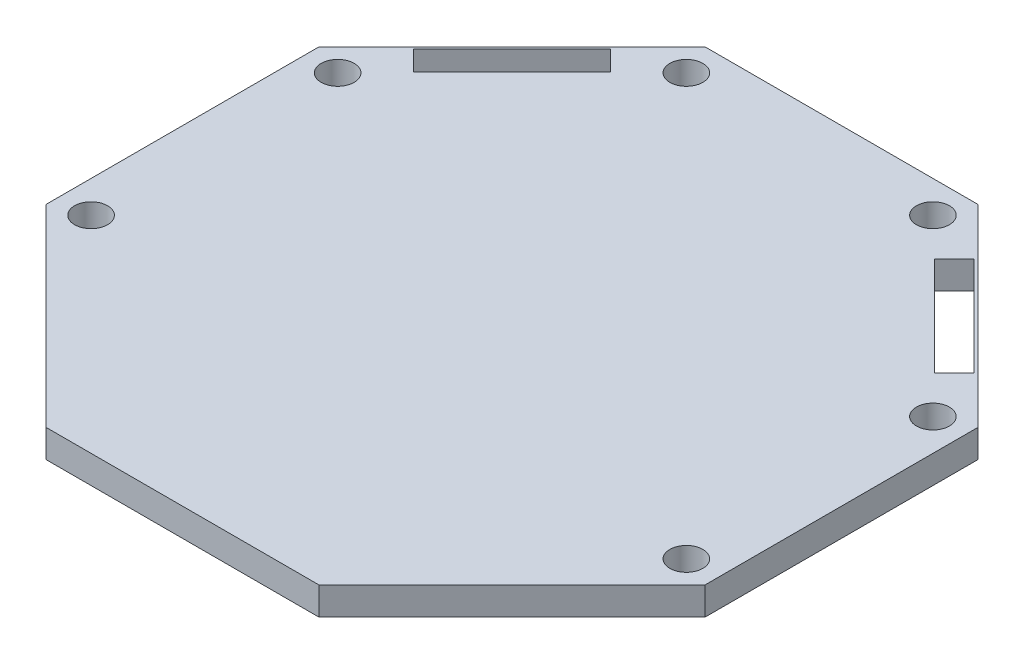
ISO-10303-21;
HEADER;
FILE_DESCRIPTION(('STEP AP214'),'2;1');
FILE_NAME('part.step','',(''),(''),'','','');
FILE_SCHEMA(('AUTOMOTIVE_DESIGN { 1 0 10303 214 1 1 1 1 }'));
ENDSEC;
DATA;
#1=APPLICATION_CONTEXT('core data for automotive mechanical design processes');
#2=APPLICATION_PROTOCOL_DEFINITION('international standard','automotive_design',2000,#1);
#3=PRODUCT_CONTEXT('',#1,'mechanical');
#4=PRODUCT('Part','Part','',(#3));
#5=PRODUCT_RELATED_PRODUCT_CATEGORY('part','',(#4));
#6=PRODUCT_DEFINITION_FORMATION('','',#4);
#7=PRODUCT_DEFINITION_CONTEXT('part definition',#1,'design');
#8=PRODUCT_DEFINITION('design','',#6,#7);
#9=PRODUCT_DEFINITION_SHAPE('','',#8);
#10=(LENGTH_UNIT() NAMED_UNIT(*) SI_UNIT(.MILLI.,.METRE.));
#11=(NAMED_UNIT(*) PLANE_ANGLE_UNIT() SI_UNIT($,.RADIAN.));
#12=(NAMED_UNIT(*) SI_UNIT($,.STERADIAN.) SOLID_ANGLE_UNIT());
#13=UNCERTAINTY_MEASURE_WITH_UNIT(LENGTH_MEASURE(1.E-05),#10,'distance_accuracy_value','');
#14=(GEOMETRIC_REPRESENTATION_CONTEXT(3) GLOBAL_UNCERTAINTY_ASSIGNED_CONTEXT((#13)) GLOBAL_UNIT_ASSIGNED_CONTEXT((#10,
#11,#12)) REPRESENTATION_CONTEXT('',''));
#15=CARTESIAN_POINT('',(0.,0.,0.));
#16=DIRECTION('',(0.,0.,1.));
#17=DIRECTION('',(1.,0.,0.));
#18=AXIS2_PLACEMENT_3D('',#15,#16,#17);
#19=CARTESIAN_POINT('',(50.9857993233023,2.54,-50.9857993233014));
#20=DIRECTION('',(-0.707106781186554,0.,0.707106781186541));
#21=DIRECTION('',(0.707106781186541,0.,0.707106781186554));
#22=AXIS2_PLACEMENT_3D('',#19,#20,#21);
#23=PLANE('',#22);
#24=DIRECTION('',(-0.707106781186541,0.,-0.707106781186554));
#25=VECTOR('',#24,1.);
#26=CARTESIAN_POINT('',(50.9857993233023,0.,-50.9857993233014));
#27=LINE('',#26,#25);
#28=CARTESIAN_POINT('',(55.4759273838363,0.,-46.4956712627672));
#29=VERTEX_POINT('',#28);
#30=CARTESIAN_POINT('',(46.4956712627675,0.,-55.4759273838362));
#31=VERTEX_POINT('',#30);
#32=EDGE_CURVE('E287',#29,#31,#27,.T.);
#33=ORIENTED_EDGE('',*,*,#32,.F.);
#34=DIRECTION('',(0.,-1.,0.));
#35=VECTOR('',#34,1.);
#36=CARTESIAN_POINT('',(55.4759273838363,2.54,-46.4956712627672));
#37=LINE('',#36,#35);
#38=CARTESIAN_POINT('',(55.4759273838363,2.54,-46.4956712627672));
#39=VERTEX_POINT('',#38);
#40=EDGE_CURVE('E11',#39,#29,#37,.T.);
#41=ORIENTED_EDGE('',*,*,#40,.F.);
#42=DIRECTION('',(-0.707106781186541,0.,-0.707106781186554));
#43=VECTOR('',#42,1.);
#44=CARTESIAN_POINT('',(50.9857993233023,2.54,-50.9857993233014));
#45=LINE('',#44,#43);
#46=CARTESIAN_POINT('',(46.4956712627675,2.54,-55.4759273838362));
#47=VERTEX_POINT('',#46);
#48=EDGE_CURVE('E168',#39,#47,#45,.T.);
#49=ORIENTED_EDGE('',*,*,#48,.T.);
#50=DIRECTION('',(0.,-1.,0.));
#51=VECTOR('',#50,1.);
#52=CARTESIAN_POINT('',(46.4956712627675,2.54,-55.4759273838362));
#53=LINE('',#52,#51);
#54=EDGE_CURVE('E53',#47,#31,#53,.T.);
#55=ORIENTED_EDGE('',*,*,#54,.T.);
#56=EDGE_LOOP('',(#33,#41,#49,#55));
#57=FACE_BOUND('',#56,.T.);
#58=ADVANCED_FACE('F34',(#57),#23,.T.);
#59=CARTESIAN_POINT('',(4.4901280605311,2.54,4.49012806053165));
#60=DIRECTION('',(0.707106781186504,0.,0.707106781186591));
#61=DIRECTION('',(0.707106781186591,0.,-0.707106781186504));
#62=AXIS2_PLACEMENT_3D('',#59,#60,#61);
#63=PLANE('',#62);
#64=DIRECTION('',(-0.707106781186591,0.,0.707106781186504));
#65=VECTOR('',#64,1.);
#66=CARTESIAN_POINT('',(4.4901280605311,0.,4.49012806053165));
#67=LINE('',#66,#65);
#68=CARTESIAN_POINT('',(53.6798761596227,0.,-44.6996200385539));
#69=VERTEX_POINT('',#68);
#70=EDGE_CURVE('E173',#29,#69,#67,.T.);
#71=ORIENTED_EDGE('',*,*,#70,.T.);
#72=DIRECTION('',(0.,-1.,0.));
#73=VECTOR('',#72,1.);
#74=CARTESIAN_POINT('',(53.6798761596227,2.54,-44.6996200385539));
#75=LINE('',#74,#73);
#76=CARTESIAN_POINT('',(53.6798761596227,2.54,-44.6996200385539));
#77=VERTEX_POINT('',#76);
#78=EDGE_CURVE('E44',#77,#69,#75,.T.);
#79=ORIENTED_EDGE('',*,*,#78,.F.);
#80=DIRECTION('',(-0.707106781186591,0.,0.707106781186504));
#81=VECTOR('',#80,1.);
#82=CARTESIAN_POINT('',(4.4901280605311,2.54,4.49012806053165));
#83=LINE('',#82,#81);
#84=EDGE_CURVE('E163',#39,#77,#83,.T.);
#85=ORIENTED_EDGE('',*,*,#84,.F.);
#86=ORIENTED_EDGE('',*,*,#40,.T.);
#87=EDGE_LOOP('',(#71,#79,#85,#86));
#88=FACE_BOUND('',#87,.T.);
#89=ADVANCED_FACE('F171',(#88),#63,.F.);
#90=CARTESIAN_POINT('',(49.1897480990865,2.54,-49.1897480990898));
#91=DIRECTION('',(-0.707106781186524,0.,0.707106781186571));
#92=DIRECTION('',(0.707106781186571,0.,0.707106781186524));
#93=AXIS2_PLACEMENT_3D('',#90,#91,#92);
#94=PLANE('',#93);
#95=DIRECTION('',(-0.707106781186571,0.,-0.707106781186524));
#96=VECTOR('',#95,1.);
#97=CARTESIAN_POINT('',(49.1897480990865,0.,-49.1897480990898));
#98=LINE('',#97,#96);
#99=CARTESIAN_POINT('',(44.6996200385534,0.,-53.6798761596226));
#100=VERTEX_POINT('',#99);
#101=EDGE_CURVE('E290',#69,#100,#98,.T.);
#102=ORIENTED_EDGE('',*,*,#101,.T.);
#103=DIRECTION('',(0.,-1.,0.));
#104=VECTOR('',#103,1.);
#105=CARTESIAN_POINT('',(44.6996200385534,2.54,-53.6798761596226));
#106=LINE('',#105,#104);
#107=CARTESIAN_POINT('',(44.6996200385534,2.54,-53.6798761596226));
#108=VERTEX_POINT('',#107);
#109=EDGE_CURVE('E103',#108,#100,#106,.T.);
#110=ORIENTED_EDGE('',*,*,#109,.F.);
#111=DIRECTION('',(-0.707106781186571,0.,-0.707106781186524));
#112=VECTOR('',#111,1.);
#113=CARTESIAN_POINT('',(49.1897480990865,2.54,-49.1897480990898));
#114=LINE('',#113,#112);
#115=EDGE_CURVE('E155',#77,#108,#114,.T.);
#116=ORIENTED_EDGE('',*,*,#115,.F.);
#117=ORIENTED_EDGE('',*,*,#78,.T.);
#118=EDGE_LOOP('',(#102,#110,#116,#117));
#119=FACE_BOUND('',#118,.T.);
#120=ADVANCED_FACE('F157',(#119),#94,.F.);
#121=CARTESIAN_POINT('',(21.1934044457232,2.54,21.1934044457232));
#122=DIRECTION('',(-0.707106781186548,0.,-0.707106781186547));
#123=DIRECTION('',(-0.707106781186547,0.,0.707106781186548));
#124=AXIS2_PLACEMENT_3D('',#121,#122,#123);
#125=PLANE('',#124);
#126=DIRECTION('',(0.707106781186547,0.,-0.707106781186548));
#127=VECTOR('',#126,1.);
#128=CARTESIAN_POINT('',(21.1934044457232,0.,21.1934044457232));
#129=LINE('',#128,#127);
#130=CARTESIAN_POINT('',(42.3868088914464,0.,0.));
#131=VERTEX_POINT('',#130);
#132=CARTESIAN_POINT('',(59.944,0.,-17.5571911085536));
#133=VERTEX_POINT('',#132);
#134=EDGE_CURVE('E270',#131,#133,#129,.T.);
#135=ORIENTED_EDGE('',*,*,#134,.T.);
#136=DIRECTION('',(0.,-1.,0.));
#137=VECTOR('',#136,1.);
#138=CARTESIAN_POINT('',(59.944,2.54,-17.5571911085536));
#139=LINE('',#138,#137);
#140=CARTESIAN_POINT('',(59.944,2.54,-17.5571911085536));
#141=VERTEX_POINT('',#140);
#142=EDGE_CURVE('E199',#141,#133,#139,.T.);
#143=ORIENTED_EDGE('',*,*,#142,.F.);
#144=DIRECTION('',(0.707106781186547,0.,-0.707106781186548));
#145=VECTOR('',#144,1.);
#146=CARTESIAN_POINT('',(21.1934044457232,2.54,21.1934044457232));
#147=LINE('',#146,#145);
#148=CARTESIAN_POINT('',(42.3868088914464,2.54,0.));
#149=VERTEX_POINT('',#148);
#150=EDGE_CURVE('E241',#149,#141,#147,.T.);
#151=ORIENTED_EDGE('',*,*,#150,.F.);
#152=DIRECTION('',(0.,-1.,0.));
#153=VECTOR('',#152,1.);
#154=CARTESIAN_POINT('',(42.3868088914464,2.54,0.));
#155=LINE('',#154,#153);
#156=EDGE_CURVE('E178',#149,#131,#155,.T.);
#157=ORIENTED_EDGE('',*,*,#156,.T.);
#158=EDGE_LOOP('',(#135,#143,#151,#157));
#159=FACE_BOUND('',#158,.T.);
#160=ADVANCED_FACE('F344',(#159),#125,.F.);
#161=CARTESIAN_POINT('',(59.944,2.54,0.));
#162=DIRECTION('',(-1.,0.,0.));
#163=DIRECTION('',(0.,0.,1.));
#164=AXIS2_PLACEMENT_3D('',#161,#162,#163);
#165=PLANE('',#164);
#166=DIRECTION('',(0.,0.,-1.));
#167=VECTOR('',#166,1.);
#168=CARTESIAN_POINT('',(59.944,0.,0.));
#169=LINE('',#168,#167);
#170=CARTESIAN_POINT('',(59.944,0.,-42.3868088914464));
#171=VERTEX_POINT('',#170);
#172=EDGE_CURVE('E273',#133,#171,#169,.T.);
#173=ORIENTED_EDGE('',*,*,#172,.T.);
#174=DIRECTION('',(0.,-1.,0.));
#175=VECTOR('',#174,1.);
#176=CARTESIAN_POINT('',(59.944,2.54,-42.3868088914464));
#177=LINE('',#176,#175);
#178=CARTESIAN_POINT('',(59.944,2.54,-42.3868088914464));
#179=VERTEX_POINT('',#178);
#180=EDGE_CURVE('E196',#179,#171,#177,.T.);
#181=ORIENTED_EDGE('',*,*,#180,.F.);
#182=DIRECTION('',(0.,0.,-1.));
#183=VECTOR('',#182,1.);
#184=CARTESIAN_POINT('',(59.944,2.54,0.));
#185=LINE('',#184,#183);
#186=EDGE_CURVE('E244',#141,#179,#185,.T.);
#187=ORIENTED_EDGE('',*,*,#186,.F.);
#188=ORIENTED_EDGE('',*,*,#142,.T.);
#189=EDGE_LOOP('',(#173,#181,#187,#188));
#190=FACE_BOUND('',#189,.T.);
#191=ADVANCED_FACE('F340',(#190),#165,.F.);
#192=CARTESIAN_POINT('',(51.1654044457232,2.54,-51.1654044457232));
#193=DIRECTION('',(-0.707106781186547,0.,0.707106781186548));
#194=DIRECTION('',(0.707106781186548,0.,0.707106781186547));
#195=AXIS2_PLACEMENT_3D('',#192,#193,#194);
#196=PLANE('',#195);
#197=DIRECTION('',(-0.707106781186548,0.,-0.707106781186547));
#198=VECTOR('',#197,1.);
#199=CARTESIAN_POINT('',(51.1654044457232,0.,-51.1654044457232));
#200=LINE('',#199,#198);
#201=CARTESIAN_POINT('',(42.3868088914464,0.,-59.944));
#202=VERTEX_POINT('',#201);
#203=EDGE_CURVE('E275',#171,#202,#200,.T.);
#204=ORIENTED_EDGE('',*,*,#203,.T.);
#205=DIRECTION('',(0.,-1.,0.));
#206=VECTOR('',#205,1.);
#207=CARTESIAN_POINT('',(42.3868088914464,2.54,-59.944));
#208=LINE('',#207,#206);
#209=CARTESIAN_POINT('',(42.3868088914464,2.54,-59.944));
#210=VERTEX_POINT('',#209);
#211=EDGE_CURVE('E193',#210,#202,#208,.T.);
#212=ORIENTED_EDGE('',*,*,#211,.F.);
#213=DIRECTION('',(-0.707106781186548,0.,-0.707106781186547));
#214=VECTOR('',#213,1.);
#215=CARTESIAN_POINT('',(51.1654044457232,2.54,-51.1654044457232));
#216=LINE('',#215,#214);
#217=EDGE_CURVE('E246',#179,#210,#216,.T.);
#218=ORIENTED_EDGE('',*,*,#217,.F.);
#219=ORIENTED_EDGE('',*,*,#180,.T.);
#220=EDGE_LOOP('',(#204,#212,#218,#219));
#221=FACE_BOUND('',#220,.T.);
#222=ADVANCED_FACE('F336',(#221),#196,.F.);
#223=CARTESIAN_POINT('',(0.,2.54,-59.944));
#224=DIRECTION('',(0.,0.,1.));
#225=DIRECTION('',(1.,0.,0.));
#226=AXIS2_PLACEMENT_3D('',#223,#224,#225);
#227=PLANE('',#226);
#228=DIRECTION('',(-1.,0.,0.));
#229=VECTOR('',#228,1.);
#230=CARTESIAN_POINT('',(0.,0.,-59.944));
#231=LINE('',#230,#229);
#232=CARTESIAN_POINT('',(17.5571911085536,0.,-59.944));
#233=VERTEX_POINT('',#232);
#234=EDGE_CURVE('E277',#202,#233,#231,.T.);
#235=ORIENTED_EDGE('',*,*,#234,.T.);
#236=DIRECTION('',(0.,-1.,0.));
#237=VECTOR('',#236,1.);
#238=CARTESIAN_POINT('',(17.5571911085536,2.54,-59.944));
#239=LINE('',#238,#237);
#240=CARTESIAN_POINT('',(17.5571911085536,2.54,-59.944));
#241=VERTEX_POINT('',#240);
#242=EDGE_CURVE('E190',#241,#233,#239,.T.);
#243=ORIENTED_EDGE('',*,*,#242,.F.);
#244=DIRECTION('',(-1.,0.,0.));
#245=VECTOR('',#244,1.);
#246=CARTESIAN_POINT('',(0.,2.54,-59.944));
#247=LINE('',#246,#245);
#248=EDGE_CURVE('E248',#210,#241,#247,.T.);
#249=ORIENTED_EDGE('',*,*,#248,.F.);
#250=ORIENTED_EDGE('',*,*,#211,.T.);
#251=EDGE_LOOP('',(#235,#243,#249,#250));
#252=FACE_BOUND('',#251,.T.);
#253=ADVANCED_FACE('F332',(#252),#227,.F.);
#254=CARTESIAN_POINT('',(-21.1934044457232,2.54,-21.1934044457232));
#255=DIRECTION('',(0.707106781186548,0.,0.707106781186547));
#256=DIRECTION('',(0.707106781186547,0.,-0.707106781186548));
#257=AXIS2_PLACEMENT_3D('',#254,#255,#256);
#258=PLANE('',#257);
#259=DIRECTION('',(-0.707106781186547,0.,0.707106781186548));
#260=VECTOR('',#259,1.);
#261=CARTESIAN_POINT('',(-21.1934044457232,0.,-21.1934044457232));
#262=LINE('',#261,#260);
#263=CARTESIAN_POINT('',(0.,0.,-42.3868088914464));
#264=VERTEX_POINT('',#263);
#265=EDGE_CURVE('E279',#233,#264,#262,.T.);
#266=ORIENTED_EDGE('',*,*,#265,.T.);
#267=DIRECTION('',(0.,-1.,0.));
#268=VECTOR('',#267,1.);
#269=CARTESIAN_POINT('',(0.,2.54,-42.3868088914464));
#270=LINE('',#269,#268);
#271=CARTESIAN_POINT('',(0.,2.54,-42.3868088914464));
#272=VERTEX_POINT('',#271);
#273=EDGE_CURVE('E187',#272,#264,#270,.T.);
#274=ORIENTED_EDGE('',*,*,#273,.F.);
#275=DIRECTION('',(-0.707106781186547,0.,0.707106781186548));
#276=VECTOR('',#275,1.);
#277=CARTESIAN_POINT('',(-21.1934044457232,2.54,-21.1934044457232));
#278=LINE('',#277,#276);
#279=EDGE_CURVE('E250',#241,#272,#278,.T.);
#280=ORIENTED_EDGE('',*,*,#279,.F.);
#281=ORIENTED_EDGE('',*,*,#242,.T.);
#282=EDGE_LOOP('',(#266,#274,#280,#281));
#283=FACE_BOUND('',#282,.T.);
#284=ADVANCED_FACE('F328',(#283),#258,.F.);
#285=CARTESIAN_POINT('',(0.,2.54,0.));
#286=DIRECTION('',(1.,0.,0.));
#287=DIRECTION('',(0.,0.,-1.));
#288=AXIS2_PLACEMENT_3D('',#285,#286,#287);
#289=PLANE('',#288);
#290=DIRECTION('',(0.,0.,1.));
#291=VECTOR('',#290,1.);
#292=CARTESIAN_POINT('',(0.,0.,0.));
#293=LINE('',#292,#291);
#294=CARTESIAN_POINT('',(0.,0.,-17.5571911085536));
#295=VERTEX_POINT('',#294);
#296=EDGE_CURVE('E281',#264,#295,#293,.T.);
#297=ORIENTED_EDGE('',*,*,#296,.T.);
#298=DIRECTION('',(0.,-1.,0.));
#299=VECTOR('',#298,1.);
#300=CARTESIAN_POINT('',(0.,2.54,-17.5571911085536));
#301=LINE('',#300,#299);
#302=CARTESIAN_POINT('',(0.,2.54,-17.5571911085536));
#303=VERTEX_POINT('',#302);
#304=EDGE_CURVE('E184',#303,#295,#301,.T.);
#305=ORIENTED_EDGE('',*,*,#304,.F.);
#306=DIRECTION('',(0.,0.,1.));
#307=VECTOR('',#306,1.);
#308=CARTESIAN_POINT('',(0.,2.54,0.));
#309=LINE('',#308,#307);
#310=EDGE_CURVE('E252',#272,#303,#309,.T.);
#311=ORIENTED_EDGE('',*,*,#310,.F.);
#312=ORIENTED_EDGE('',*,*,#273,.T.);
#313=EDGE_LOOP('',(#297,#305,#311,#312));
#314=FACE_BOUND('',#313,.T.);
#315=ADVANCED_FACE('F324',(#314),#289,.F.);
#316=CARTESIAN_POINT('',(8.7785955542768,2.54,-8.7785955542768));
#317=DIRECTION('',(0.707106781186547,0.,-0.707106781186548));
#318=DIRECTION('',(-0.707106781186548,0.,-0.707106781186547));
#319=AXIS2_PLACEMENT_3D('',#316,#317,#318);
#320=PLANE('',#319);
#321=DIRECTION('',(0.707106781186548,0.,0.707106781186547));
#322=VECTOR('',#321,1.);
#323=CARTESIAN_POINT('',(8.7785955542768,0.,-8.7785955542768));
#324=LINE('',#323,#322);
#325=CARTESIAN_POINT('',(17.5571911085536,0.,0.));
#326=VERTEX_POINT('',#325);
#327=EDGE_CURVE('E283',#295,#326,#324,.T.);
#328=ORIENTED_EDGE('',*,*,#327,.T.);
#329=DIRECTION('',(0.,-1.,0.));
#330=VECTOR('',#329,1.);
#331=CARTESIAN_POINT('',(17.5571911085536,2.54,0.));
#332=LINE('',#331,#330);
#333=CARTESIAN_POINT('',(17.5571911085536,2.54,0.));
#334=VERTEX_POINT('',#333);
#335=EDGE_CURVE('E181',#334,#326,#332,.T.);
#336=ORIENTED_EDGE('',*,*,#335,.F.);
#337=DIRECTION('',(0.707106781186548,0.,0.707106781186547));
#338=VECTOR('',#337,1.);
#339=CARTESIAN_POINT('',(8.7785955542768,2.54,-8.7785955542768));
#340=LINE('',#339,#338);
#341=EDGE_CURVE('E254',#303,#334,#340,.T.);
#342=ORIENTED_EDGE('',*,*,#341,.F.);
#343=ORIENTED_EDGE('',*,*,#304,.T.);
#344=EDGE_LOOP('',(#328,#336,#342,#343));
#345=FACE_BOUND('',#344,.T.);
#346=ADVANCED_FACE('F321',(#345),#320,.F.);
#347=CARTESIAN_POINT('',(25.4818719394655,2.54,-25.4818719394647));
#348=DIRECTION('',(0.707106781186559,0.,-0.707106781186536));
#349=DIRECTION('',(-0.707106781186536,0.,-0.707106781186559));
#350=AXIS2_PLACEMENT_3D('',#347,#348,#349);
#351=PLANE('',#350);
#352=DIRECTION('',(0.707106781186536,0.,0.707106781186559));
#353=VECTOR('',#352,1.);
#354=CARTESIAN_POINT('',(25.4818719394655,0.,-25.4818719394647));
#355=LINE('',#354,#353);
#356=CARTESIAN_POINT('',(4.46807261616372,0.,-46.4956712627672));
#357=VERTEX_POINT('',#356);
#358=CARTESIAN_POINT('',(6.2641238403776,0.,-44.6996200385533));
#359=VERTEX_POINT('',#358);
#360=EDGE_CURVE('E230',#357,#359,#355,.T.);
#361=ORIENTED_EDGE('',*,*,#360,.F.);
#362=DIRECTION('',(0.,-1.,0.));
#363=VECTOR('',#362,1.);
#364=CARTESIAN_POINT('',(4.46807261616372,2.54,-46.4956712627672));
#365=LINE('',#364,#363);
#366=CARTESIAN_POINT('',(4.46807261616372,2.54,-46.4956712627672));
#367=VERTEX_POINT('',#366);
#368=EDGE_CURVE('E115',#367,#357,#365,.T.);
#369=ORIENTED_EDGE('',*,*,#368,.F.);
#370=DIRECTION('',(0.707106781186536,0.,0.707106781186559));
#371=VECTOR('',#370,1.);
#372=CARTESIAN_POINT('',(25.4818719394655,2.54,-25.4818719394647));
#373=LINE('',#372,#371);
#374=CARTESIAN_POINT('',(6.2641238403776,2.54,-44.6996200385533));
#375=VERTEX_POINT('',#374);
#376=EDGE_CURVE('E231',#367,#375,#373,.T.);
#377=ORIENTED_EDGE('',*,*,#376,.T.);
#378=DIRECTION('',(0.,-1.,0.));
#379=VECTOR('',#378,1.);
#380=CARTESIAN_POINT('',(6.2641238403776,2.54,-44.6996200385533));
#381=LINE('',#380,#379);
#382=EDGE_CURVE('E202',#375,#359,#381,.T.);
#383=ORIENTED_EDGE('',*,*,#382,.T.);
#384=EDGE_LOOP('',(#361,#369,#377,#383));
#385=FACE_BOUND('',#384,.T.);
#386=ADVANCED_FACE('F36',(#385),#351,.T.);
#387=CARTESIAN_POINT('',(-21.0137993233017,2.54,-21.0137993233013));
#388=DIRECTION('',(-0.707106781186554,0.,-0.707106781186541));
#389=DIRECTION('',(-0.707106781186541,0.,0.707106781186554));
#390=AXIS2_PLACEMENT_3D('',#387,#388,#389);
#391=PLANE('',#390);
#392=DIRECTION('',(0.707106781186541,0.,-0.707106781186554));
#393=VECTOR('',#392,1.);
#394=CARTESIAN_POINT('',(-21.0137993233017,0.,-21.0137993233013));
#395=LINE('',#394,#393);
#396=CARTESIAN_POINT('',(13.4483287372325,0.,-55.4759273838362));
#397=VERTEX_POINT('',#396);
#398=EDGE_CURVE('E262',#357,#397,#395,.T.);
#399=ORIENTED_EDGE('',*,*,#398,.T.);
#400=DIRECTION('',(0.,-1.,0.));
#401=VECTOR('',#400,1.);
#402=CARTESIAN_POINT('',(13.4483287372325,2.54,-55.4759273838362));
#403=LINE('',#402,#401);
#404=CARTESIAN_POINT('',(13.4483287372325,2.54,-55.4759273838362));
#405=VERTEX_POINT('',#404);
#406=EDGE_CURVE('E206',#405,#397,#403,.T.);
#407=ORIENTED_EDGE('',*,*,#406,.F.);
#408=DIRECTION('',(0.707106781186541,0.,-0.707106781186554));
#409=VECTOR('',#408,1.);
#410=CARTESIAN_POINT('',(-21.0137993233017,2.54,-21.0137993233013));
#411=LINE('',#410,#409);
#412=EDGE_CURVE('E233',#367,#405,#411,.T.);
#413=ORIENTED_EDGE('',*,*,#412,.F.);
#414=ORIENTED_EDGE('',*,*,#368,.T.);
#415=EDGE_LOOP('',(#399,#407,#413,#414));
#416=FACE_BOUND('',#415,.T.);
#417=ADVANCED_FACE('F350',(#416),#391,.F.);
#418=CARTESIAN_POINT('',(34.4621280605325,2.54,-34.4621280605419));
#419=DIRECTION('',(0.707106781186452,0.,-0.707106781186643));
#420=DIRECTION('',(-0.707106781186643,0.,-0.707106781186452));
#421=AXIS2_PLACEMENT_3D('',#418,#419,#420);
#422=PLANE('',#421);
#423=DIRECTION('',(0.707106781186643,0.,0.707106781186452));
#424=VECTOR('',#423,1.);
#425=CARTESIAN_POINT('',(34.4621280605325,0.,-34.4621280605419));
#426=LINE('',#425,#424);
#427=CARTESIAN_POINT('',(15.2443799614466,0.,-53.6798761596226));
#428=VERTEX_POINT('',#427);
#429=EDGE_CURVE('E264',#397,#428,#426,.T.);
#430=ORIENTED_EDGE('',*,*,#429,.T.);
#431=DIRECTION('',(0.,-1.,0.));
#432=VECTOR('',#431,1.);
#433=CARTESIAN_POINT('',(15.2443799614466,2.54,-53.6798761596226));
#434=LINE('',#433,#432);
#435=CARTESIAN_POINT('',(15.2443799614466,2.54,-53.6798761596226));
#436=VERTEX_POINT('',#435);
#437=EDGE_CURVE('E204',#436,#428,#434,.T.);
#438=ORIENTED_EDGE('',*,*,#437,.F.);
#439=DIRECTION('',(0.707106781186643,0.,0.707106781186452));
#440=VECTOR('',#439,1.);
#441=CARTESIAN_POINT('',(34.4621280605325,2.54,-34.4621280605419));
#442=LINE('',#441,#440);
#443=EDGE_CURVE('E236',#405,#436,#442,.T.);
#444=ORIENTED_EDGE('',*,*,#443,.F.);
#445=ORIENTED_EDGE('',*,*,#406,.T.);
#446=EDGE_LOOP('',(#430,#438,#444,#445));
#447=FACE_BOUND('',#446,.T.);
#448=ADVANCED_FACE('F319',(#447),#422,.F.);
#449=CARTESIAN_POINT('',(0.,2.54,0.));
#450=DIRECTION('',(0.,0.,-1.));
#451=DIRECTION('',(-1.,0.,0.));
#452=AXIS2_PLACEMENT_3D('',#449,#450,#451);
#453=PLANE('',#452);
#454=DIRECTION('',(1.,0.,0.));
#455=VECTOR('',#454,1.);
#456=CARTESIAN_POINT('',(0.,0.,0.));
#457=LINE('',#456,#455);
#458=EDGE_CURVE('E285',#326,#131,#457,.T.);
#459=ORIENTED_EDGE('',*,*,#458,.T.);
#460=ORIENTED_EDGE('',*,*,#156,.F.);
#461=DIRECTION('',(1.,0.,0.));
#462=VECTOR('',#461,1.);
#463=CARTESIAN_POINT('',(0.,2.54,0.));
#464=LINE('',#463,#462);
#465=EDGE_CURVE('E256',#334,#149,#464,.T.);
#466=ORIENTED_EDGE('',*,*,#465,.F.);
#467=ORIENTED_EDGE('',*,*,#335,.T.);
#468=EDGE_LOOP('',(#459,#460,#466,#467));
#469=FACE_BOUND('',#468,.T.);
#470=ADVANCED_FACE('F305',(#469),#453,.F.);
#471=CARTESIAN_POINT('',(-19.2177480990877,2.54,-19.217748099087));
#472=DIRECTION('',(-0.707106781186561,0.,-0.707106781186534));
#473=DIRECTION('',(-0.707106781186534,0.,0.707106781186561));
#474=AXIS2_PLACEMENT_3D('',#471,#472,#473);
#475=PLANE('',#474);
#476=DIRECTION('',(0.707106781186534,0.,-0.707106781186561));
#477=VECTOR('',#476,1.);
#478=CARTESIAN_POINT('',(-19.2177480990877,0.,-19.217748099087));
#479=LINE('',#478,#477);
#480=EDGE_CURVE('E267',#359,#428,#479,.T.);
#481=ORIENTED_EDGE('',*,*,#480,.F.);
#482=ORIENTED_EDGE('',*,*,#382,.F.);
#483=DIRECTION('',(0.707106781186534,0.,-0.707106781186561));
#484=VECTOR('',#483,1.);
#485=CARTESIAN_POINT('',(-19.2177480990877,2.54,-19.217748099087));
#486=LINE('',#485,#484);
#487=EDGE_CURVE('E238',#375,#436,#486,.T.);
#488=ORIENTED_EDGE('',*,*,#487,.T.);
#489=ORIENTED_EDGE('',*,*,#437,.T.);
#490=EDGE_LOOP('',(#481,#482,#488,#489));
#491=FACE_BOUND('',#490,.T.);
#492=ADVANCED_FACE('F297',(#491),#475,.T.);
#493=CARTESIAN_POINT('',(-4.49012806054003,2.54,-4.49012806054112));
#494=DIRECTION('',(0.707106781186462,0.,0.707106781186634));
#495=DIRECTION('',(0.707106781186634,0.,-0.707106781186462));
#496=AXIS2_PLACEMENT_3D('',#493,#494,#495);
#497=PLANE('',#496);
#498=DIRECTION('',(-0.707106781186634,0.,0.707106781186462));
#499=VECTOR('',#498,1.);
#500=CARTESIAN_POINT('',(-4.49012806054003,0.,-4.49012806054112));
#501=LINE('',#500,#499);
#502=EDGE_CURVE('E234',#31,#100,#501,.T.);
#503=ORIENTED_EDGE('',*,*,#502,.F.);
#504=ORIENTED_EDGE('',*,*,#54,.F.);
#505=DIRECTION('',(-0.707106781186634,0.,0.707106781186462));
#506=VECTOR('',#505,1.);
#507=CARTESIAN_POINT('',(-4.49012806054003,2.54,-4.49012806054112));
#508=LINE('',#507,#506);
#509=EDGE_CURVE('E162',#47,#108,#508,.T.);
#510=ORIENTED_EDGE('',*,*,#509,.T.);
#511=ORIENTED_EDGE('',*,*,#109,.T.);
#512=EDGE_LOOP('',(#503,#504,#510,#511));
#513=FACE_BOUND('',#512,.T.);
#514=ADVANCED_FACE('F295',(#513),#497,.T.);
#515=CARTESIAN_POINT('',(0.,2.54,0.));
#516=DIRECTION('',(0.,1.,0.));
#517=DIRECTION('',(0.,0.,1.));
#518=AXIS2_PLACEMENT_3D('',#515,#516,#517);
#519=PLANE('',#518);
#520=CARTESIAN_POINT('',(2.9,2.54,-18.7584104394356));
#521=DIRECTION('',(0.,1.,0.));
#522=DIRECTION('',(0.,0.,1.));
#523=AXIS2_PLACEMENT_3D('',#520,#521,#522);
#524=CIRCLE('',#523,1.49999999999999);
#525=CARTESIAN_POINT('',(2.9,2.54,-17.2584104394356));
#526=VERTEX_POINT('',#525);
#527=EDGE_CURVE('E425',#526,#526,#524,.T.);
#528=ORIENTED_EDGE('',*,*,#527,.F.);
#529=EDGE_LOOP('',(#528));
#530=FACE_BOUND('',#529,.T.);
#531=CARTESIAN_POINT('',(57.04399999991,2.54,-18.7584104394728));
#532=DIRECTION('',(0.,1.,0.));
#533=DIRECTION('',(0.,0.,1.));
#534=AXIS2_PLACEMENT_3D('',#531,#532,#533);
#535=CIRCLE('',#534,1.49999999999999);
#536=CARTESIAN_POINT('',(57.04399999991,2.54,-17.2584104394728));
#537=VERTEX_POINT('',#536);
#538=EDGE_CURVE('E427',#537,#537,#535,.T.);
#539=ORIENTED_EDGE('',*,*,#538,.F.);
#540=EDGE_LOOP('',(#539));
#541=FACE_BOUND('',#540,.T.);
#542=CARTESIAN_POINT('',(2.9,2.54,-41.1855895604372));
#543=DIRECTION('',(0.,1.,0.));
#544=DIRECTION('',(0.,0.,1.));
#545=AXIS2_PLACEMENT_3D('',#542,#543,#544);
#546=CIRCLE('',#545,1.49999999999999);
#547=CARTESIAN_POINT('',(2.9,2.54,-39.6855895604372));
#548=VERTEX_POINT('',#547);
#549=EDGE_CURVE('E435',#548,#548,#546,.T.);
#550=ORIENTED_EDGE('',*,*,#549,.F.);
#551=EDGE_LOOP('',(#550));
#552=FACE_BOUND('',#551,.T.);
#553=CARTESIAN_POINT('',(57.04399999991,2.54,-41.1855895605271));
#554=DIRECTION('',(0.,1.,0.));
#555=DIRECTION('',(0.,0.,1.));
#556=AXIS2_PLACEMENT_3D('',#553,#554,#555);
#557=CIRCLE('',#556,1.49999999999999);
#558=CARTESIAN_POINT('',(57.04399999991,2.54,-39.6855895605272));
#559=VERTEX_POINT('',#558);
#560=EDGE_CURVE('E224',#559,#559,#557,.T.);
#561=ORIENTED_EDGE('',*,*,#560,.F.);
#562=EDGE_LOOP('',(#561));
#563=FACE_BOUND('',#562,.T.);
#564=CARTESIAN_POINT('',(18.7584104394728,2.54,-57.04399999991));
#565=DIRECTION('',(0.,1.,0.));
#566=DIRECTION('',(0.,0.,1.));
#567=AXIS2_PLACEMENT_3D('',#564,#565,#566);
#568=CIRCLE('',#567,1.49999999999999);
#569=CARTESIAN_POINT('',(18.7584104394728,2.54,-55.54399999991));
#570=VERTEX_POINT('',#569);
#571=EDGE_CURVE('E212',#570,#570,#568,.T.);
#572=ORIENTED_EDGE('',*,*,#571,.F.);
#573=EDGE_LOOP('',(#572));
#574=FACE_BOUND('',#573,.T.);
#575=CARTESIAN_POINT('',(41.1855895605272,2.54,-57.04399999991));
#576=DIRECTION('',(0.,1.,0.));
#577=DIRECTION('',(0.,0.,1.));
#578=AXIS2_PLACEMENT_3D('',#575,#576,#577);
#579=CIRCLE('',#578,1.49999999999999);
#580=CARTESIAN_POINT('',(41.1855895605272,2.54,-55.54399999991));
#581=VERTEX_POINT('',#580);
#582=EDGE_CURVE('E211',#581,#581,#579,.T.);
#583=ORIENTED_EDGE('',*,*,#582,.F.);
#584=EDGE_LOOP('',(#583));
#585=FACE_BOUND('',#584,.T.);
#586=ORIENTED_EDGE('',*,*,#376,.F.);
#587=ORIENTED_EDGE('',*,*,#412,.T.);
#588=ORIENTED_EDGE('',*,*,#443,.T.);
#589=ORIENTED_EDGE('',*,*,#487,.F.);
#590=EDGE_LOOP('',(#586,#587,#588,#589));
#591=FACE_BOUND('',#590,.T.);
#592=ORIENTED_EDGE('',*,*,#150,.T.);
#593=ORIENTED_EDGE('',*,*,#186,.T.);
#594=ORIENTED_EDGE('',*,*,#217,.T.);
#595=ORIENTED_EDGE('',*,*,#248,.T.);
#596=ORIENTED_EDGE('',*,*,#279,.T.);
#597=ORIENTED_EDGE('',*,*,#310,.T.);
#598=ORIENTED_EDGE('',*,*,#341,.T.);
#599=ORIENTED_EDGE('',*,*,#465,.T.);
#600=EDGE_LOOP('',(#592,#593,#594,#595,#596,#597,#598,#599));
#601=FACE_BOUND('',#600,.T.);
#602=ORIENTED_EDGE('',*,*,#48,.F.);
#603=ORIENTED_EDGE('',*,*,#84,.T.);
#604=ORIENTED_EDGE('',*,*,#115,.T.);
#605=ORIENTED_EDGE('',*,*,#509,.F.);
#606=EDGE_LOOP('',(#602,#603,#604,#605));
#607=FACE_BOUND('',#606,.T.);
#608=ADVANCED_FACE('F167',(#530,#541,#552,#563,#574,#585,#591,#601,#607),#519,.T.);
#609=CARTESIAN_POINT('',(0.,0.,0.));
#610=DIRECTION('',(0.,1.,0.));
#611=DIRECTION('',(0.,0.,1.));
#612=AXIS2_PLACEMENT_3D('',#609,#610,#611);
#613=PLANE('',#612);
#614=CARTESIAN_POINT('',(2.9,0.,-18.7584104394356));
#615=DIRECTION('',(0.,1.,0.));
#616=DIRECTION('',(0.,0.,1.));
#617=AXIS2_PLACEMENT_3D('',#614,#615,#616);
#618=CIRCLE('',#617,1.49999999999999);
#619=CARTESIAN_POINT('',(2.9,0.,-17.2584104394356));
#620=VERTEX_POINT('',#619);
#621=EDGE_CURVE('E38',#620,#620,#618,.T.);
#622=ORIENTED_EDGE('',*,*,#621,.T.);
#623=EDGE_LOOP('',(#622));
#624=FACE_BOUND('',#623,.T.);
#625=CARTESIAN_POINT('',(57.04399999991,0.,-18.7584104394728));
#626=DIRECTION('',(0.,1.,0.));
#627=DIRECTION('',(0.,0.,1.));
#628=AXIS2_PLACEMENT_3D('',#625,#626,#627);
#629=CIRCLE('',#628,1.49999999999999);
#630=CARTESIAN_POINT('',(57.04399999991,0.,-17.2584104394728));
#631=VERTEX_POINT('',#630);
#632=EDGE_CURVE('E429',#631,#631,#629,.T.);
#633=ORIENTED_EDGE('',*,*,#632,.T.);
#634=EDGE_LOOP('',(#633));
#635=FACE_BOUND('',#634,.T.);
#636=CARTESIAN_POINT('',(2.9,0.,-41.1855895604372));
#637=DIRECTION('',(0.,1.,0.));
#638=DIRECTION('',(0.,0.,1.));
#639=AXIS2_PLACEMENT_3D('',#636,#637,#638);
#640=CIRCLE('',#639,1.49999999999999);
#641=CARTESIAN_POINT('',(2.9,0.,-39.6855895604372));
#642=VERTEX_POINT('',#641);
#643=EDGE_CURVE('E438',#642,#642,#640,.T.);
#644=ORIENTED_EDGE('',*,*,#643,.T.);
#645=EDGE_LOOP('',(#644));
#646=FACE_BOUND('',#645,.T.);
#647=CARTESIAN_POINT('',(57.04399999991,0.,-41.1855895605271));
#648=DIRECTION('',(0.,1.,0.));
#649=DIRECTION('',(0.,0.,1.));
#650=AXIS2_PLACEMENT_3D('',#647,#648,#649);
#651=CIRCLE('',#650,1.49999999999999);
#652=CARTESIAN_POINT('',(57.04399999991,0.,-39.6855895605272));
#653=VERTEX_POINT('',#652);
#654=EDGE_CURVE('E219',#653,#653,#651,.T.);
#655=ORIENTED_EDGE('',*,*,#654,.T.);
#656=EDGE_LOOP('',(#655));
#657=FACE_BOUND('',#656,.T.);
#658=CARTESIAN_POINT('',(18.7584104394728,0.,-57.04399999991));
#659=DIRECTION('',(0.,1.,0.));
#660=DIRECTION('',(0.,0.,1.));
#661=AXIS2_PLACEMENT_3D('',#658,#659,#660);
#662=CIRCLE('',#661,1.49999999999999);
#663=CARTESIAN_POINT('',(18.7584104394728,0.,-55.54399999991));
#664=VERTEX_POINT('',#663);
#665=EDGE_CURVE('E209',#664,#664,#662,.T.);
#666=ORIENTED_EDGE('',*,*,#665,.T.);
#667=EDGE_LOOP('',(#666));
#668=FACE_BOUND('',#667,.T.);
#669=CARTESIAN_POINT('',(41.1855895605272,0.,-57.04399999991));
#670=DIRECTION('',(0.,1.,0.));
#671=DIRECTION('',(0.,0.,1.));
#672=AXIS2_PLACEMENT_3D('',#669,#670,#671);
#673=CIRCLE('',#672,1.49999999999999);
#674=CARTESIAN_POINT('',(41.1855895605272,0.,-55.54399999991));
#675=VERTEX_POINT('',#674);
#676=EDGE_CURVE('E216',#675,#675,#673,.T.);
#677=ORIENTED_EDGE('',*,*,#676,.T.);
#678=EDGE_LOOP('',(#677));
#679=FACE_BOUND('',#678,.T.);
#680=ORIENTED_EDGE('',*,*,#360,.T.);
#681=ORIENTED_EDGE('',*,*,#480,.T.);
#682=ORIENTED_EDGE('',*,*,#429,.F.);
#683=ORIENTED_EDGE('',*,*,#398,.F.);
#684=EDGE_LOOP('',(#680,#681,#682,#683));
#685=FACE_BOUND('',#684,.T.);
#686=ORIENTED_EDGE('',*,*,#134,.F.);
#687=ORIENTED_EDGE('',*,*,#458,.F.);
#688=ORIENTED_EDGE('',*,*,#327,.F.);
#689=ORIENTED_EDGE('',*,*,#296,.F.);
#690=ORIENTED_EDGE('',*,*,#265,.F.);
#691=ORIENTED_EDGE('',*,*,#234,.F.);
#692=ORIENTED_EDGE('',*,*,#203,.F.);
#693=ORIENTED_EDGE('',*,*,#172,.F.);
#694=EDGE_LOOP('',(#686,#687,#688,#689,#690,#691,#692,#693));
#695=FACE_BOUND('',#694,.T.);
#696=ORIENTED_EDGE('',*,*,#32,.T.);
#697=ORIENTED_EDGE('',*,*,#502,.T.);
#698=ORIENTED_EDGE('',*,*,#101,.F.);
#699=ORIENTED_EDGE('',*,*,#70,.F.);
#700=EDGE_LOOP('',(#696,#697,#698,#699));
#701=FACE_BOUND('',#700,.T.);
#702=ADVANCED_FACE('F294',(#624,#635,#646,#657,#668,#679,#685,#695,#701),#613,.F.);
#703=CARTESIAN_POINT('',(41.1855895605272,2.54,-57.04399999991));
#704=DIRECTION('',(0.,1.,0.));
#705=DIRECTION('',(0.,0.,1.));
#706=AXIS2_PLACEMENT_3D('',#703,#704,#705);
#707=CYLINDRICAL_SURFACE('',#706,1.49999999999999);
#708=ORIENTED_EDGE('',*,*,#582,.T.);
#709=EDGE_LOOP('',(#708));
#710=FACE_BOUND('',#709,.T.);
#711=ORIENTED_EDGE('',*,*,#676,.F.);
#712=EDGE_LOOP('',(#711));
#713=FACE_BOUND('',#712,.T.);
#714=ADVANCED_FACE('F392',(#710,#713),#707,.F.);
#715=CARTESIAN_POINT('',(18.7584104394728,2.54,-57.04399999991));
#716=DIRECTION('',(0.,1.,0.));
#717=DIRECTION('',(0.,0.,1.));
#718=AXIS2_PLACEMENT_3D('',#715,#716,#717);
#719=CYLINDRICAL_SURFACE('',#718,1.49999999999999);
#720=ORIENTED_EDGE('',*,*,#571,.T.);
#721=EDGE_LOOP('',(#720));
#722=FACE_BOUND('',#721,.T.);
#723=ORIENTED_EDGE('',*,*,#665,.F.);
#724=EDGE_LOOP('',(#723));
#725=FACE_BOUND('',#724,.T.);
#726=ADVANCED_FACE('F397',(#722,#725),#719,.F.);
#727=CARTESIAN_POINT('',(57.04399999991,2.54,-41.1855895605271));
#728=DIRECTION('',(0.,1.,0.));
#729=DIRECTION('',(0.,0.,1.));
#730=AXIS2_PLACEMENT_3D('',#727,#728,#729);
#731=CYLINDRICAL_SURFACE('',#730,1.49999999999999);
#732=ORIENTED_EDGE('',*,*,#560,.T.);
#733=EDGE_LOOP('',(#732));
#734=FACE_BOUND('',#733,.T.);
#735=ORIENTED_EDGE('',*,*,#654,.F.);
#736=EDGE_LOOP('',(#735));
#737=FACE_BOUND('',#736,.T.);
#738=ADVANCED_FACE('F405',(#734,#737),#731,.F.);
#739=CARTESIAN_POINT('',(2.9,2.54,-41.1855895604372));
#740=DIRECTION('',(0.,1.,0.));
#741=DIRECTION('',(0.,0.,1.));
#742=AXIS2_PLACEMENT_3D('',#739,#740,#741);
#743=CYLINDRICAL_SURFACE('',#742,1.49999999999999);
#744=ORIENTED_EDGE('',*,*,#549,.T.);
#745=EDGE_LOOP('',(#744));
#746=FACE_BOUND('',#745,.T.);
#747=ORIENTED_EDGE('',*,*,#643,.F.);
#748=EDGE_LOOP('',(#747));
#749=FACE_BOUND('',#748,.T.);
#750=ADVANCED_FACE('F408',(#746,#749),#743,.F.);
#751=CARTESIAN_POINT('',(57.04399999991,2.54,-18.7584104394728));
#752=DIRECTION('',(0.,1.,0.));
#753=DIRECTION('',(0.,0.,1.));
#754=AXIS2_PLACEMENT_3D('',#751,#752,#753);
#755=CYLINDRICAL_SURFACE('',#754,1.49999999999999);
#756=ORIENTED_EDGE('',*,*,#538,.T.);
#757=EDGE_LOOP('',(#756));
#758=FACE_BOUND('',#757,.T.);
#759=ORIENTED_EDGE('',*,*,#632,.F.);
#760=EDGE_LOOP('',(#759));
#761=FACE_BOUND('',#760,.T.);
#762=ADVANCED_FACE('F412',(#758,#761),#755,.F.);
#763=CARTESIAN_POINT('',(2.9,2.54,-18.7584104394356));
#764=DIRECTION('',(0.,1.,0.));
#765=DIRECTION('',(0.,0.,1.));
#766=AXIS2_PLACEMENT_3D('',#763,#764,#765);
#767=CYLINDRICAL_SURFACE('',#766,1.49999999999999);
#768=ORIENTED_EDGE('',*,*,#527,.T.);
#769=EDGE_LOOP('',(#768));
#770=FACE_BOUND('',#769,.T.);
#771=ORIENTED_EDGE('',*,*,#621,.F.);
#772=EDGE_LOOP('',(#771));
#773=FACE_BOUND('',#772,.T.);
#774=ADVANCED_FACE('F416',(#770,#773),#767,.F.);
#775=CLOSED_SHELL('',(#58,#89,#120,#160,#191,#222,#253,#284,#315,#346,#386,#417,#448,#470,#492,
#514,#608,#702,#714,#726,#738,#750,#762,#774));
#776=MANIFOLD_SOLID_BREP('B2',#775);
#777=ADVANCED_BREP_SHAPE_REPRESENTATION('',(#18,#776),#14);
#778=SHAPE_DEFINITION_REPRESENTATION(#9,#777);
ENDSEC;
END-ISO-10303-21;
